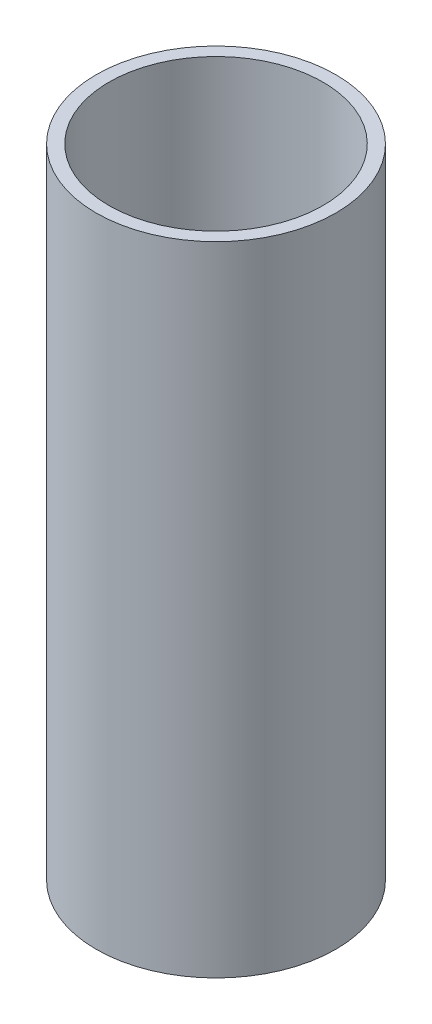
ISO-10303-21;
HEADER;
FILE_DESCRIPTION(('STEP AP214'),'2;1');
FILE_NAME('part.step','',(''),(''),'','','');
FILE_SCHEMA(('AUTOMOTIVE_DESIGN { 1 0 10303 214 1 1 1 1 }'));
ENDSEC;
DATA;
#1=APPLICATION_CONTEXT('core data for automotive mechanical design processes');
#2=APPLICATION_PROTOCOL_DEFINITION('international standard','automotive_design',2000,#1);
#3=PRODUCT_CONTEXT('',#1,'mechanical');
#4=PRODUCT('Part','Part','',(#3));
#5=PRODUCT_RELATED_PRODUCT_CATEGORY('part','',(#4));
#6=PRODUCT_DEFINITION_FORMATION('','',#4);
#7=PRODUCT_DEFINITION_CONTEXT('part definition',#1,'design');
#8=PRODUCT_DEFINITION('design','',#6,#7);
#9=PRODUCT_DEFINITION_SHAPE('','',#8);
#10=(LENGTH_UNIT() NAMED_UNIT(*) SI_UNIT(.MILLI.,.METRE.));
#11=(NAMED_UNIT(*) PLANE_ANGLE_UNIT() SI_UNIT($,.RADIAN.));
#12=(NAMED_UNIT(*) SI_UNIT($,.STERADIAN.) SOLID_ANGLE_UNIT());
#13=UNCERTAINTY_MEASURE_WITH_UNIT(LENGTH_MEASURE(1.E-05),#10,'distance_accuracy_value','');
#14=(GEOMETRIC_REPRESENTATION_CONTEXT(3) GLOBAL_UNCERTAINTY_ASSIGNED_CONTEXT((#13)) GLOBAL_UNIT_ASSIGNED_CONTEXT((#10,
#11,#12)) REPRESENTATION_CONTEXT('',''));
#15=CARTESIAN_POINT('',(0.,0.,0.));
#16=DIRECTION('',(0.,0.,1.));
#17=DIRECTION('',(1.,0.,0.));
#18=AXIS2_PLACEMENT_3D('',#15,#16,#17);
#19=CARTESIAN_POINT('',(0.,74.498,0.));
#20=DIRECTION('',(0.,1.,0.));
#21=DIRECTION('',(0.,0.,1.));
#22=AXIS2_PLACEMENT_3D('',#19,#20,#21);
#23=PLANE('',#22);
#24=CARTESIAN_POINT('',(0.,74.498,0.));
#25=DIRECTION('',(0.,1.,0.));
#26=DIRECTION('',(0.,0.,1.));
#27=AXIS2_PLACEMENT_3D('',#24,#25,#26);
#28=CIRCLE('',#27,14.);
#29=CARTESIAN_POINT('',(0.,74.498,14.));
#30=VERTEX_POINT('',#29);
#31=EDGE_CURVE('E10',#30,#30,#28,.T.);
#32=ORIENTED_EDGE('',*,*,#31,.T.);
#33=EDGE_LOOP('',(#32));
#34=FACE_BOUND('',#33,.T.);
#35=CARTESIAN_POINT('',(0.,74.498,0.));
#36=DIRECTION('',(0.,1.,0.));
#37=DIRECTION('',(0.,0.,1.));
#38=AXIS2_PLACEMENT_3D('',#35,#36,#37);
#39=CIRCLE('',#38,12.5);
#40=CARTESIAN_POINT('',(0.,74.498,12.5));
#41=VERTEX_POINT('',#40);
#42=EDGE_CURVE('E42',#41,#41,#39,.T.);
#43=ORIENTED_EDGE('',*,*,#42,.F.);
#44=EDGE_LOOP('',(#43));
#45=FACE_BOUND('',#44,.T.);
#46=ADVANCED_FACE('F31',(#34,#45),#23,.T.);
#47=CARTESIAN_POINT('',(0.,0.,0.));
#48=DIRECTION('',(0.,1.,0.));
#49=DIRECTION('',(0.,0.,1.));
#50=AXIS2_PLACEMENT_3D('',#47,#48,#49);
#51=PLANE('',#50);
#52=CARTESIAN_POINT('',(0.,0.,0.));
#53=DIRECTION('',(0.,1.,0.));
#54=DIRECTION('',(0.,0.,1.));
#55=AXIS2_PLACEMENT_3D('',#52,#53,#54);
#56=CIRCLE('',#55,14.);
#57=CARTESIAN_POINT('',(0.,0.,14.));
#58=VERTEX_POINT('',#57);
#59=EDGE_CURVE('E35',#58,#58,#56,.T.);
#60=ORIENTED_EDGE('',*,*,#59,.F.);
#61=EDGE_LOOP('',(#60));
#62=FACE_BOUND('',#61,.T.);
#63=CARTESIAN_POINT('',(0.,0.,0.));
#64=DIRECTION('',(0.,1.,0.));
#65=DIRECTION('',(0.,0.,1.));
#66=AXIS2_PLACEMENT_3D('',#63,#64,#65);
#67=CIRCLE('',#66,12.5);
#68=CARTESIAN_POINT('',(0.,0.,12.5));
#69=VERTEX_POINT('',#68);
#70=EDGE_CURVE('E44',#69,#69,#67,.T.);
#71=ORIENTED_EDGE('',*,*,#70,.T.);
#72=EDGE_LOOP('',(#71));
#73=FACE_BOUND('',#72,.T.);
#74=ADVANCED_FACE('F54',(#62,#73),#51,.F.);
#75=CARTESIAN_POINT('',(0.,74.498,0.));
#76=DIRECTION('',(0.,-1.,0.));
#77=DIRECTION('',(0.,0.,-1.));
#78=AXIS2_PLACEMENT_3D('',#75,#76,#77);
#79=CYLINDRICAL_SURFACE('',#78,14.);
#80=ORIENTED_EDGE('',*,*,#31,.F.);
#81=EDGE_LOOP('',(#80));
#82=FACE_BOUND('',#81,.T.);
#83=ORIENTED_EDGE('',*,*,#59,.T.);
#84=EDGE_LOOP('',(#83));
#85=FACE_BOUND('',#84,.T.);
#86=ADVANCED_FACE('F33',(#82,#85),#79,.T.);
#87=CARTESIAN_POINT('',(0.,74.498,0.));
#88=DIRECTION('',(0.,-1.,0.));
#89=DIRECTION('',(0.,0.,-1.));
#90=AXIS2_PLACEMENT_3D('',#87,#88,#89);
#91=CYLINDRICAL_SURFACE('',#90,12.5);
#92=ORIENTED_EDGE('',*,*,#42,.T.);
#93=EDGE_LOOP('',(#92));
#94=FACE_BOUND('',#93,.T.);
#95=ORIENTED_EDGE('',*,*,#70,.F.);
#96=EDGE_LOOP('',(#95));
#97=FACE_BOUND('',#96,.T.);
#98=ADVANCED_FACE('F50',(#94,#97),#91,.F.);
#99=CLOSED_SHELL('',(#46,#74,#86,#98));
#100=MANIFOLD_SOLID_BREP('B2',#99);
#101=ADVANCED_BREP_SHAPE_REPRESENTATION('',(#18,#100),#14);
#102=SHAPE_DEFINITION_REPRESENTATION(#9,#101);
ENDSEC;
END-ISO-10303-21;
